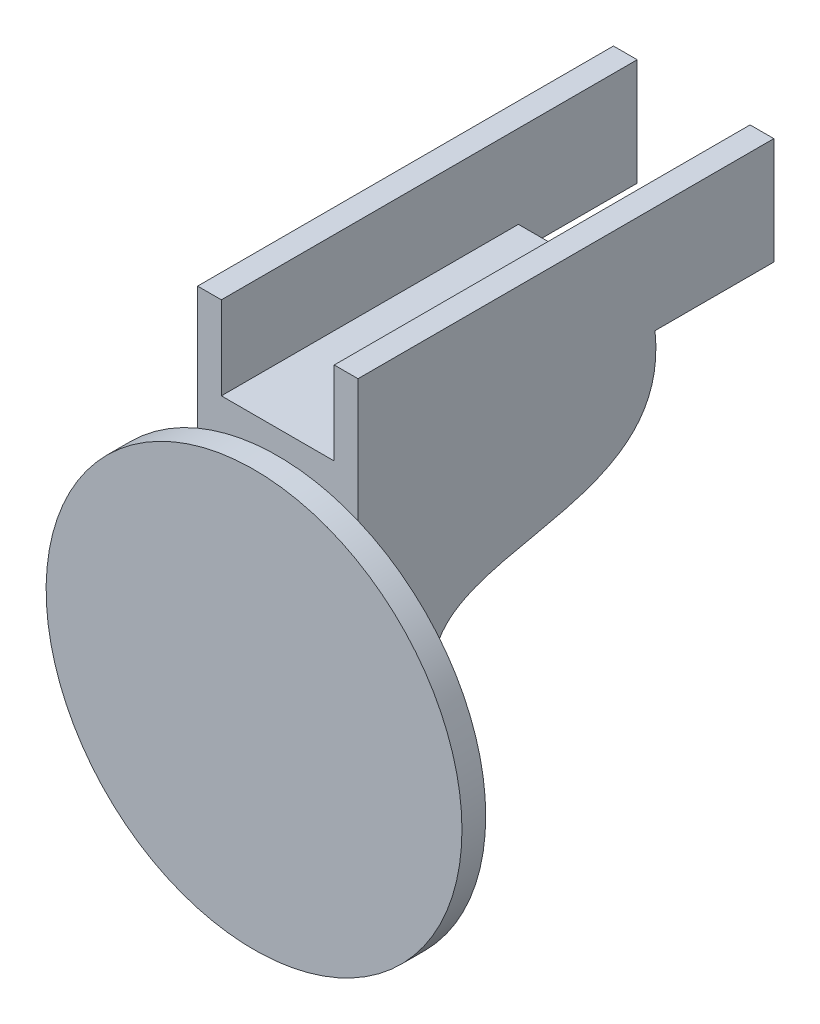
ISO-10303-21;
HEADER;
FILE_DESCRIPTION(('STEP AP214'),'2;1');
FILE_NAME('part.step','',(''),(''),'','','');
FILE_SCHEMA(('AUTOMOTIVE_DESIGN { 1 0 10303 214 1 1 1 1 }'));
ENDSEC;
DATA;
#1=APPLICATION_CONTEXT('core data for automotive mechanical design processes');
#2=APPLICATION_PROTOCOL_DEFINITION('international standard','automotive_design',2000,#1);
#3=PRODUCT_CONTEXT('',#1,'mechanical');
#4=PRODUCT('Part','Part','',(#3));
#5=PRODUCT_RELATED_PRODUCT_CATEGORY('part','',(#4));
#6=PRODUCT_DEFINITION_FORMATION('','',#4);
#7=PRODUCT_DEFINITION_CONTEXT('part definition',#1,'design');
#8=PRODUCT_DEFINITION('design','',#6,#7);
#9=PRODUCT_DEFINITION_SHAPE('','',#8);
#10=(LENGTH_UNIT() NAMED_UNIT(*) SI_UNIT(.MILLI.,.METRE.));
#11=(NAMED_UNIT(*) PLANE_ANGLE_UNIT() SI_UNIT($,.RADIAN.));
#12=(NAMED_UNIT(*) SI_UNIT($,.STERADIAN.) SOLID_ANGLE_UNIT());
#13=UNCERTAINTY_MEASURE_WITH_UNIT(LENGTH_MEASURE(1.E-05),#10,'distance_accuracy_value','');
#14=(GEOMETRIC_REPRESENTATION_CONTEXT(3) GLOBAL_UNCERTAINTY_ASSIGNED_CONTEXT((#13)) GLOBAL_UNIT_ASSIGNED_CONTEXT((#10,
#11,#12)) REPRESENTATION_CONTEXT('',''));
#15=CARTESIAN_POINT('',(0.,0.,0.));
#16=DIRECTION('',(0.,0.,1.));
#17=DIRECTION('',(1.,0.,0.));
#18=AXIS2_PLACEMENT_3D('',#15,#16,#17);
#19=CARTESIAN_POINT('',(-193.63213122225,-20.9301361800688,35.));
#20=DIRECTION('',(0.,1.,0.));
#21=DIRECTION('',(0.,0.,1.));
#22=AXIS2_PLACEMENT_3D('',#19,#20,#21);
#23=PLANE('',#22);
#24=DIRECTION('',(0.,0.,-1.));
#25=VECTOR('',#24,1.);
#26=CARTESIAN_POINT('',(-193.63213122225,-20.9301361800688,35.));
#27=LINE('',#26,#25);
#28=CARTESIAN_POINT('',(-193.63213122225,-20.9301361800688,10.));
#29=VERTEX_POINT('',#28);
#30=CARTESIAN_POINT('',(-193.63213122225,-20.9301361800688,0.));
#31=VERTEX_POINT('',#30);
#32=EDGE_CURVE('E227',#29,#31,#27,.T.);
#33=ORIENTED_EDGE('',*,*,#32,.F.);
#34=DIRECTION('',(1.,0.,0.));
#35=VECTOR('',#34,1.);
#36=CARTESIAN_POINT('',(-207.13213122225,-20.9301361800688,10.));
#37=LINE('',#36,#35);
#38=CARTESIAN_POINT('',(-195.63213122225,-20.9301361800688,10.));
#39=VERTEX_POINT('',#38);
#40=EDGE_CURVE('E163',#39,#29,#37,.T.);
#41=ORIENTED_EDGE('',*,*,#40,.F.);
#42=DIRECTION('',(0.,0.,-1.));
#43=VECTOR('',#42,1.);
#44=CARTESIAN_POINT('',(-195.63213122225,-20.9301361800688,35.));
#45=LINE('',#44,#43);
#46=CARTESIAN_POINT('',(-195.63213122225,-20.9301361800688,0.));
#47=VERTEX_POINT('',#46);
#48=EDGE_CURVE('E248',#39,#47,#45,.T.);
#49=ORIENTED_EDGE('',*,*,#48,.T.);
#50=DIRECTION('',(1.,0.,0.));
#51=VECTOR('',#50,1.);
#52=CARTESIAN_POINT('',(-193.63213122225,-20.9301361800688,0.));
#53=LINE('',#52,#51);
#54=EDGE_CURVE('E232',#47,#31,#53,.T.);
#55=ORIENTED_EDGE('',*,*,#54,.T.);
#56=EDGE_LOOP('',(#33,#41,#49,#55));
#57=FACE_BOUND('',#56,.T.);
#58=ADVANCED_FACE('F33',(#57),#23,.F.);
#59=CARTESIAN_POINT('',(0.,0.,0.));
#60=DIRECTION('',(0.,0.,-1.));
#61=DIRECTION('',(-1.,0.,0.));
#62=AXIS2_PLACEMENT_3D('',#59,#60,#61);
#63=PLANE('',#62);
#64=DIRECTION('',(0.,1.,0.));
#65=VECTOR('',#64,1.);
#66=CARTESIAN_POINT('',(-205.13213122225,-11.9301361800688,0.));
#67=LINE('',#66,#65);
#68=CARTESIAN_POINT('',(-205.13213122225,-20.9301361800688,0.));
#69=VERTEX_POINT('',#68);
#70=CARTESIAN_POINT('',(-205.13213122225,-11.9301361800688,0.));
#71=VERTEX_POINT('',#70);
#72=EDGE_CURVE('E260',#69,#71,#67,.T.);
#73=ORIENTED_EDGE('',*,*,#72,.F.);
#74=CARTESIAN_POINT('',(-207.13213122225,-20.9301361800688,0.));
#75=VERTEX_POINT('',#74);
#76=EDGE_CURVE('E278',#75,#69,#53,.T.);
#77=ORIENTED_EDGE('',*,*,#76,.F.);
#78=DIRECTION('',(0.,-1.,0.));
#79=VECTOR('',#78,1.);
#80=CARTESIAN_POINT('',(-207.13213122225,-20.9301361800688,0.));
#81=LINE('',#80,#79);
#82=CARTESIAN_POINT('',(-207.13213122225,-11.9301361800688,0.));
#83=VERTEX_POINT('',#82);
#84=EDGE_CURVE('E275',#83,#75,#81,.T.);
#85=ORIENTED_EDGE('',*,*,#84,.F.);
#86=DIRECTION('',(-1.,0.,0.));
#87=VECTOR('',#86,1.);
#88=CARTESIAN_POINT('',(-207.13213122225,-11.9301361800688,0.));
#89=LINE('',#88,#87);
#90=EDGE_CURVE('E255',#71,#83,#89,.T.);
#91=ORIENTED_EDGE('',*,*,#90,.F.);
#92=EDGE_LOOP('',(#73,#77,#85,#91));
#93=FACE_BOUND('',#92,.T.);
#94=ADVANCED_FACE('F189',(#93),#63,.T.);
#95=CARTESIAN_POINT('',(-207.13213122225,-11.9301361800688,35.));
#96=DIRECTION('',(0.,-1.,0.));
#97=DIRECTION('',(0.,0.,-1.));
#98=AXIS2_PLACEMENT_3D('',#95,#96,#97);
#99=PLANE('',#98);
#100=ORIENTED_EDGE('',*,*,#90,.T.);
#101=DIRECTION('',(0.,0.,-1.));
#102=VECTOR('',#101,1.);
#103=CARTESIAN_POINT('',(-207.13213122225,-11.9301361800688,35.));
#104=LINE('',#103,#102);
#105=CARTESIAN_POINT('',(-207.13213122225,-11.9301361800688,35.));
#106=VERTEX_POINT('',#105);
#107=EDGE_CURVE('E47',#106,#83,#104,.T.);
#108=ORIENTED_EDGE('',*,*,#107,.F.);
#109=DIRECTION('',(-1.,0.,0.));
#110=VECTOR('',#109,1.);
#111=CARTESIAN_POINT('',(-207.13213122225,-11.9301361800688,35.));
#112=LINE('',#111,#110);
#113=CARTESIAN_POINT('',(-205.13213122225,-11.9301361800688,35.));
#114=VERTEX_POINT('',#113);
#115=EDGE_CURVE('E256',#114,#106,#112,.T.);
#116=ORIENTED_EDGE('',*,*,#115,.F.);
#117=DIRECTION('',(0.,0.,-1.));
#118=VECTOR('',#117,1.);
#119=CARTESIAN_POINT('',(-205.13213122225,-11.9301361800688,35.));
#120=LINE('',#119,#118);
#121=EDGE_CURVE('E272',#114,#71,#120,.T.);
#122=ORIENTED_EDGE('',*,*,#121,.T.);
#123=EDGE_LOOP('',(#100,#108,#116,#122));
#124=FACE_BOUND('',#123,.T.);
#125=ADVANCED_FACE('F35',(#124),#99,.F.);
#126=CARTESIAN_POINT('',(-207.13213122225,-20.9301361800688,35.));
#127=DIRECTION('',(1.,0.,0.));
#128=DIRECTION('',(0.,0.,-1.));
#129=AXIS2_PLACEMENT_3D('',#126,#127,#128);
#130=PLANE('',#129);
#131=CARTESIAN_POINT('',(-207.13213122225,-55.9301361800688,35.));
#132=CARTESIAN_POINT('',(-207.13213122225,-54.2873215879042,23.0609088412956));
#133=CARTESIAN_POINT('',(-207.13213122225,-25.1690256027346,40.4363403410607));
#134=CARTESIAN_POINT('',(-207.13213122225,-32.6227513641706,8.75468883506231));
#135=CARTESIAN_POINT('',(-207.13213122225,-20.9301361800688,10.));
#136=B_SPLINE_CURVE_WITH_KNOTS('',3,(#131,#132,#133,#134,#135),.UNSPECIFIED.,.F.,.F.,(4,1,4),
(0.,0.529196365880174,1.),.UNSPECIFIED.);
#137=CARTESIAN_POINT('',(-207.13213122225,-54.5759560725363,31.2410451819246));
#138=VERTEX_POINT('',#137);
#139=CARTESIAN_POINT('',(-207.13213122225,-20.9301361800688,10.));
#140=VERTEX_POINT('',#139);
#141=EDGE_CURVE('E141',#138,#140,#136,.T.);
#142=ORIENTED_EDGE('',*,*,#141,.F.);
#143=DIRECTION('',(0.,0.,1.));
#144=VECTOR('',#143,1.);
#145=CARTESIAN_POINT('',(-207.13213122225,-54.5759560725363,30.));
#146=LINE('',#145,#144);
#147=CARTESIAN_POINT('',(-207.13213122225,-54.5759560725363,35.));
#148=VERTEX_POINT('',#147);
#149=EDGE_CURVE('E135',#138,#148,#146,.T.);
#150=ORIENTED_EDGE('',*,*,#149,.T.);
#151=DIRECTION('',(0.,-1.,0.));
#152=VECTOR('',#151,1.);
#153=CARTESIAN_POINT('',(-207.13213122225,-20.9301361800688,35.));
#154=LINE('',#153,#152);
#155=CARTESIAN_POINT('',(-207.13213122225,-22.2843162876013,35.));
#156=VERTEX_POINT('',#155);
#157=EDGE_CURVE('E138',#156,#148,#154,.T.);
#158=ORIENTED_EDGE('',*,*,#157,.F.);
#159=DIRECTION('',(0.,-1.,0.));
#160=VECTOR('',#159,1.);
#161=CARTESIAN_POINT('',(-207.13213122225,-11.9301361800688,35.));
#162=LINE('',#161,#160);
#163=EDGE_CURVE('E259',#106,#156,#162,.T.);
#164=ORIENTED_EDGE('',*,*,#163,.F.);
#165=ORIENTED_EDGE('',*,*,#107,.T.);
#166=ORIENTED_EDGE('',*,*,#84,.T.);
#167=DIRECTION('',(0.,0.,-1.));
#168=VECTOR('',#167,1.);
#169=CARTESIAN_POINT('',(-207.13213122225,-20.9301361800688,35.));
#170=LINE('',#169,#168);
#171=EDGE_CURVE('E234',#140,#75,#170,.T.);
#172=ORIENTED_EDGE('',*,*,#171,.F.);
#173=EDGE_LOOP('',(#142,#150,#158,#164,#165,#166,#172));
#174=FACE_BOUND('',#173,.T.);
#175=ADVANCED_FACE('F137',(#174),#130,.F.);
#176=DIRECTION('',(0.,0.,1.));
#177=VECTOR('',#176,1.);
#178=CARTESIAN_POINT('',(-205.13213122225,-20.9301361800688,35.));
#179=LINE('',#178,#177);
#180=CARTESIAN_POINT('',(-205.13213122225,-20.9301361800688,10.));
#181=VERTEX_POINT('',#180);
#182=EDGE_CURVE('E251',#69,#181,#179,.T.);
#183=ORIENTED_EDGE('',*,*,#182,.T.);
#184=EDGE_CURVE('E240',#140,#181,#37,.T.);
#185=ORIENTED_EDGE('',*,*,#184,.F.);
#186=ORIENTED_EDGE('',*,*,#171,.T.);
#187=ORIENTED_EDGE('',*,*,#76,.T.);
#188=EDGE_LOOP('',(#183,#185,#186,#187));
#189=FACE_BOUND('',#188,.T.);
#190=ADVANCED_FACE('F208',(#189),#23,.F.);
#191=CARTESIAN_POINT('',(-193.63213122225,-11.9301361800688,35.));
#192=DIRECTION('',(-1.,0.,0.));
#193=DIRECTION('',(0.,0.,1.));
#194=AXIS2_PLACEMENT_3D('',#191,#192,#193);
#195=PLANE('',#194);
#196=DIRECTION('',(0.,1.,0.));
#197=VECTOR('',#196,1.);
#198=CARTESIAN_POINT('',(-193.63213122225,-11.9301361800688,35.));
#199=LINE('',#198,#197);
#200=CARTESIAN_POINT('',(-193.63213122225,-54.5759560725363,35.));
#201=VERTEX_POINT('',#200);
#202=CARTESIAN_POINT('',(-193.63213122225,-22.2843162876013,35.));
#203=VERTEX_POINT('',#202);
#204=EDGE_CURVE('E148',#201,#203,#199,.T.);
#205=ORIENTED_EDGE('',*,*,#204,.F.);
#206=DIRECTION('',(0.,0.,1.));
#207=VECTOR('',#206,1.);
#208=CARTESIAN_POINT('',(-193.63213122225,-54.5759560725363,30.));
#209=LINE('',#208,#207);
#210=CARTESIAN_POINT('',(-193.63213122225,-54.5759560725363,31.2410451819244));
#211=VERTEX_POINT('',#210);
#212=EDGE_CURVE('E61',#211,#201,#209,.T.);
#213=ORIENTED_EDGE('',*,*,#212,.F.);
#214=CARTESIAN_POINT('',(-193.63213122225,-55.9301361800688,35.));
#215=CARTESIAN_POINT('',(-193.63213122225,-54.2873215879042,23.0609088412956));
#216=CARTESIAN_POINT('',(-193.63213122225,-25.1690256027346,40.4363403410607));
#217=CARTESIAN_POINT('',(-193.63213122225,-32.6227513641706,8.75468883506231));
#218=CARTESIAN_POINT('',(-193.63213122225,-20.9301361800688,10.));
#219=B_SPLINE_CURVE_WITH_KNOTS('',3,(#214,#215,#216,#217,#218),.UNSPECIFIED.,.F.,.F.,(4,1,4),
(0.,0.529196365880174,1.),.UNSPECIFIED.);
#220=EDGE_CURVE('E147',#211,#29,#219,.T.);
#221=ORIENTED_EDGE('',*,*,#220,.T.);
#222=ORIENTED_EDGE('',*,*,#32,.T.);
#223=DIRECTION('',(0.,1.,0.));
#224=VECTOR('',#223,1.);
#225=CARTESIAN_POINT('',(-193.63213122225,-11.9301361800688,0.));
#226=LINE('',#225,#224);
#227=CARTESIAN_POINT('',(-193.63213122225,-11.9301361800688,0.));
#228=VERTEX_POINT('',#227);
#229=EDGE_CURVE('E281',#31,#228,#226,.T.);
#230=ORIENTED_EDGE('',*,*,#229,.T.);
#231=DIRECTION('',(0.,0.,-1.));
#232=VECTOR('',#231,1.);
#233=CARTESIAN_POINT('',(-193.63213122225,-11.9301361800688,35.));
#234=LINE('',#233,#232);
#235=CARTESIAN_POINT('',(-193.63213122225,-11.9301361800688,35.));
#236=VERTEX_POINT('',#235);
#237=EDGE_CURVE('E235',#236,#228,#234,.T.);
#238=ORIENTED_EDGE('',*,*,#237,.F.);
#239=DIRECTION('',(0.,1.,0.));
#240=VECTOR('',#239,1.);
#241=CARTESIAN_POINT('',(-193.63213122225,-11.9301361800688,35.));
#242=LINE('',#241,#240);
#243=EDGE_CURVE('E262',#203,#236,#242,.T.);
#244=ORIENTED_EDGE('',*,*,#243,.F.);
#245=EDGE_LOOP('',(#205,#213,#221,#222,#230,#238,#244));
#246=FACE_BOUND('',#245,.T.);
#247=ADVANCED_FACE('F204',(#246),#195,.F.);
#248=CARTESIAN_POINT('',(-195.63213122225,-11.9301361800688,35.));
#249=DIRECTION('',(0.,-1.,0.));
#250=DIRECTION('',(0.,0.,-1.));
#251=AXIS2_PLACEMENT_3D('',#248,#249,#250);
#252=PLANE('',#251);
#253=DIRECTION('',(-1.,0.,0.));
#254=VECTOR('',#253,1.);
#255=CARTESIAN_POINT('',(-195.63213122225,-11.9301361800688,0.));
#256=LINE('',#255,#254);
#257=CARTESIAN_POINT('',(-195.63213122225,-11.9301361800688,0.));
#258=VERTEX_POINT('',#257);
#259=EDGE_CURVE('E283',#228,#258,#256,.T.);
#260=ORIENTED_EDGE('',*,*,#259,.T.);
#261=DIRECTION('',(0.,0.,-1.));
#262=VECTOR('',#261,1.);
#263=CARTESIAN_POINT('',(-195.63213122225,-11.9301361800688,35.));
#264=LINE('',#263,#262);
#265=CARTESIAN_POINT('',(-195.63213122225,-11.9301361800688,35.));
#266=VERTEX_POINT('',#265);
#267=EDGE_CURVE('E296',#266,#258,#264,.T.);
#268=ORIENTED_EDGE('',*,*,#267,.F.);
#269=DIRECTION('',(-1.,0.,0.));
#270=VECTOR('',#269,1.);
#271=CARTESIAN_POINT('',(-195.63213122225,-11.9301361800688,35.));
#272=LINE('',#271,#270);
#273=EDGE_CURVE('E264',#236,#266,#272,.T.);
#274=ORIENTED_EDGE('',*,*,#273,.F.);
#275=ORIENTED_EDGE('',*,*,#237,.T.);
#276=EDGE_LOOP('',(#260,#268,#274,#275));
#277=FACE_BOUND('',#276,.T.);
#278=ADVANCED_FACE('F200',(#277),#252,.F.);
#279=CARTESIAN_POINT('',(-195.63213122225,-18.9301361800688,35.));
#280=DIRECTION('',(1.,0.,0.));
#281=DIRECTION('',(0.,0.,-1.));
#282=AXIS2_PLACEMENT_3D('',#279,#280,#281);
#283=PLANE('',#282);
#284=DIRECTION('',(0.,-1.,0.));
#285=VECTOR('',#284,1.);
#286=CARTESIAN_POINT('',(-195.63213122225,-18.9301361800688,0.));
#287=LINE('',#286,#285);
#288=EDGE_CURVE('E285',#258,#47,#287,.T.);
#289=ORIENTED_EDGE('',*,*,#288,.T.);
#290=ORIENTED_EDGE('',*,*,#48,.F.);
#291=DIRECTION('',(0.,1.,0.));
#292=VECTOR('',#291,1.);
#293=CARTESIAN_POINT('',(-195.63213122225,-88.9301361800688,10.));
#294=LINE('',#293,#292);
#295=CARTESIAN_POINT('',(-195.63213122225,-18.9301361800688,10.));
#296=VERTEX_POINT('',#295);
#297=EDGE_CURVE('E246',#39,#296,#294,.T.);
#298=ORIENTED_EDGE('',*,*,#297,.T.);
#299=DIRECTION('',(0.,0.,-1.));
#300=VECTOR('',#299,1.);
#301=CARTESIAN_POINT('',(-195.63213122225,-18.9301361800688,35.));
#302=LINE('',#301,#300);
#303=CARTESIAN_POINT('',(-195.63213122225,-18.9301361800688,35.));
#304=VERTEX_POINT('',#303);
#305=EDGE_CURVE('E293',#304,#296,#302,.T.);
#306=ORIENTED_EDGE('',*,*,#305,.F.);
#307=DIRECTION('',(0.,-1.,0.));
#308=VECTOR('',#307,1.);
#309=CARTESIAN_POINT('',(-195.63213122225,-18.9301361800688,35.));
#310=LINE('',#309,#308);
#311=EDGE_CURVE('E266',#266,#304,#310,.T.);
#312=ORIENTED_EDGE('',*,*,#311,.F.);
#313=ORIENTED_EDGE('',*,*,#267,.T.);
#314=EDGE_LOOP('',(#289,#290,#298,#306,#312,#313));
#315=FACE_BOUND('',#314,.T.);
#316=ADVANCED_FACE('F196',(#315),#283,.F.);
#317=CARTESIAN_POINT('',(-205.13213122225,-18.9301361800688,35.));
#318=DIRECTION('',(0.,-1.,0.));
#319=DIRECTION('',(0.,0.,-1.));
#320=AXIS2_PLACEMENT_3D('',#317,#318,#319);
#321=PLANE('',#320);
#322=ORIENTED_EDGE('',*,*,#305,.T.);
#323=DIRECTION('',(1.,0.,0.));
#324=VECTOR('',#323,1.);
#325=CARTESIAN_POINT('',(-205.13213122225,-18.9301361800688,10.));
#326=LINE('',#325,#324);
#327=CARTESIAN_POINT('',(-205.13213122225,-18.9301361800688,10.));
#328=VERTEX_POINT('',#327);
#329=EDGE_CURVE('E241',#328,#296,#326,.T.);
#330=ORIENTED_EDGE('',*,*,#329,.F.);
#331=DIRECTION('',(0.,0.,-1.));
#332=VECTOR('',#331,1.);
#333=CARTESIAN_POINT('',(-205.13213122225,-18.9301361800688,35.));
#334=LINE('',#333,#332);
#335=CARTESIAN_POINT('',(-205.13213122225,-18.9301361800688,35.));
#336=VERTEX_POINT('',#335);
#337=EDGE_CURVE('E290',#336,#328,#334,.T.);
#338=ORIENTED_EDGE('',*,*,#337,.F.);
#339=DIRECTION('',(-1.,0.,0.));
#340=VECTOR('',#339,1.);
#341=CARTESIAN_POINT('',(-205.13213122225,-18.9301361800688,35.));
#342=LINE('',#341,#340);
#343=EDGE_CURVE('E268',#304,#336,#342,.T.);
#344=ORIENTED_EDGE('',*,*,#343,.F.);
#345=EDGE_LOOP('',(#322,#330,#338,#344));
#346=FACE_BOUND('',#345,.T.);
#347=ADVANCED_FACE('F192',(#346),#321,.F.);
#348=CARTESIAN_POINT('',(-205.13213122225,-11.9301361800688,35.));
#349=DIRECTION('',(-1.,0.,0.));
#350=DIRECTION('',(0.,0.,1.));
#351=AXIS2_PLACEMENT_3D('',#348,#349,#350);
#352=PLANE('',#351);
#353=ORIENTED_EDGE('',*,*,#72,.T.);
#354=ORIENTED_EDGE('',*,*,#121,.F.);
#355=DIRECTION('',(0.,1.,0.));
#356=VECTOR('',#355,1.);
#357=CARTESIAN_POINT('',(-205.13213122225,-11.9301361800688,35.));
#358=LINE('',#357,#356);
#359=EDGE_CURVE('E270',#336,#114,#358,.T.);
#360=ORIENTED_EDGE('',*,*,#359,.F.);
#361=ORIENTED_EDGE('',*,*,#337,.T.);
#362=DIRECTION('',(0.,1.,0.));
#363=VECTOR('',#362,1.);
#364=CARTESIAN_POINT('',(-205.13213122225,-88.9301361800688,10.));
#365=LINE('',#364,#363);
#366=EDGE_CURVE('E245',#181,#328,#365,.T.);
#367=ORIENTED_EDGE('',*,*,#366,.F.);
#368=ORIENTED_EDGE('',*,*,#182,.F.);
#369=EDGE_LOOP('',(#353,#354,#360,#361,#367,#368));
#370=FACE_BOUND('',#369,.T.);
#371=ADVANCED_FACE('F185',(#370),#352,.F.);
#372=CARTESIAN_POINT('',(0.,0.,35.));
#373=DIRECTION('',(0.,0.,-1.));
#374=DIRECTION('',(-1.,0.,0.));
#375=AXIS2_PLACEMENT_3D('',#372,#373,#374);
#376=PLANE('',#375);
#377=CARTESIAN_POINT('',(-200.38213122225,-38.4301361800688,35.));
#378=DIRECTION('',(0.,0.,1.));
#379=DIRECTION('',(1.,0.,0.));
#380=AXIS2_PLACEMENT_3D('',#377,#378,#379);
#381=CIRCLE('',#380,17.5);
#382=EDGE_CURVE('E54',#203,#156,#381,.T.);
#383=ORIENTED_EDGE('',*,*,#382,.F.);
#384=ORIENTED_EDGE('',*,*,#243,.T.);
#385=ORIENTED_EDGE('',*,*,#273,.T.);
#386=ORIENTED_EDGE('',*,*,#311,.T.);
#387=ORIENTED_EDGE('',*,*,#343,.T.);
#388=ORIENTED_EDGE('',*,*,#359,.T.);
#389=ORIENTED_EDGE('',*,*,#115,.T.);
#390=ORIENTED_EDGE('',*,*,#163,.T.);
#391=EDGE_LOOP('',(#383,#384,#385,#386,#387,#388,#389,#390));
#392=FACE_BOUND('',#391,.T.);
#393=ADVANCED_FACE('F182',(#392),#376,.F.);
#394=ORIENTED_EDGE('',*,*,#54,.F.);
#395=ORIENTED_EDGE('',*,*,#288,.F.);
#396=ORIENTED_EDGE('',*,*,#259,.F.);
#397=ORIENTED_EDGE('',*,*,#229,.F.);
#398=EDGE_LOOP('',(#394,#395,#396,#397));
#399=FACE_BOUND('',#398,.T.);
#400=ADVANCED_FACE('F180',(#399),#63,.T.);
#401=CARTESIAN_POINT('',(-205.13213122225,-88.9301361800688,10.));
#402=DIRECTION('',(0.,0.,1.));
#403=DIRECTION('',(1.,0.,0.));
#404=AXIS2_PLACEMENT_3D('',#401,#402,#403);
#405=PLANE('',#404);
#406=ORIENTED_EDGE('',*,*,#366,.T.);
#407=ORIENTED_EDGE('',*,*,#329,.T.);
#408=ORIENTED_EDGE('',*,*,#297,.F.);
#409=DIRECTION('',(1.,0.,0.));
#410=VECTOR('',#409,1.);
#411=CARTESIAN_POINT('',(-193.63213122225,-20.9301361800688,10.));
#412=LINE('',#411,#410);
#413=EDGE_CURVE('E239',#181,#39,#412,.T.);
#414=ORIENTED_EDGE('',*,*,#413,.F.);
#415=EDGE_LOOP('',(#406,#407,#408,#414));
#416=FACE_BOUND('',#415,.T.);
#417=ADVANCED_FACE('F175',(#416),#405,.F.);
#418=DIRECTION('',(1.,0.,0.));
#419=VECTOR('',#418,1.);
#420=SURFACE_OF_LINEAR_EXTRUSION('',#136,#419);
#421=CARTESIAN_POINT('',(-207.13213122225,-54.5759560725365,31.2410451819246));
#422=CARTESIAN_POINT('',(-206.998010990833,-54.6320259942286,31.3195097813312));
#423=CARTESIAN_POINT('',(-206.863864560859,-54.6861457010801,31.3993112377888));
#424=CARTESIAN_POINT('',(-206.595655939778,-54.7905400560798,31.5613282722925));
#425=CARTESIAN_POINT('',(-206.461593747009,-54.8408170204276,31.6435423541094));
#426=CARTESIAN_POINT('',(-206.193564931703,-54.9376355255816,31.8101973982224));
#427=CARTESIAN_POINT('',(-206.059598292875,-54.9841781160354,31.894637725843));
#428=CARTESIAN_POINT('',(-205.791745025642,-55.0736338772276,32.0655247802447));
#429=CARTESIAN_POINT('',(-205.657858393561,-55.1165472298891,32.1519714061788));
#430=CARTESIAN_POINT('',(-205.390495971913,-55.1987315343326,32.3263728252024));
#431=CARTESIAN_POINT('',(-205.257020041709,-55.2380119260878,32.414322963273));
#432=CARTESIAN_POINT('',(-204.990040517719,-55.3131574228797,32.5916540769216));
#433=CARTESIAN_POINT('',(-204.856536922516,-55.3490222132576,32.6810351834417));
#434=CARTESIAN_POINT('',(-204.58938379927,-55.4174267162973,32.8608505146779));
#435=CARTESIAN_POINT('',(-204.455734267439,-55.4499663405038,32.9512847673383));
#436=CARTESIAN_POINT('',(-204.188103535782,-55.5118058717735,33.1327325259375));
#437=CARTESIAN_POINT('',(-204.054122376628,-55.5411061577809,33.2237459628021));
#438=CARTESIAN_POINT('',(-203.819746891051,-55.5894844959553,33.3825508056562));
#439=CARTESIAN_POINT('',(-203.719499368761,-55.6092640588294,33.4503461336836));
#440=CARTESIAN_POINT('',(-203.518456368409,-55.6471024858568,33.5855983160217));
#441=CARTESIAN_POINT('',(-203.417660907485,-55.6651614034992,33.6530551807924));
#442=CARTESIAN_POINT('',(-203.215256588064,-55.6995873023637,33.7872278900673));
#443=CARTESIAN_POINT('',(-203.11364755548,-55.7159539104483,33.8539435682652));
#444=CARTESIAN_POINT('',(-202.909137945129,-55.7470341713043,33.9861780995918));
#445=CARTESIAN_POINT('',(-202.806235386591,-55.7617448230389,34.0516946051885));
#446=CARTESIAN_POINT('',(-202.598914951979,-55.7894796652091,34.1806283894805));
#447=CARTESIAN_POINT('',(-202.494497339697,-55.8025041454019,34.2440460274543));
#448=CARTESIAN_POINT('',(-202.283630886739,-55.8268476026083,34.3676964125766));
#449=CARTESIAN_POINT('',(-202.177182717578,-55.8381671328057,34.4279301886182));
#450=CARTESIAN_POINT('',(-201.980873821435,-55.8571815879177,34.533302455492));
#451=CARTESIAN_POINT('',(-201.891461665618,-55.8651624876435,34.5792109397601));
#452=CARTESIAN_POINT('',(-201.710429047966,-55.8798897316439,34.6666326887114));
#453=CARTESIAN_POINT('',(-201.618807950757,-55.8866357157982,34.7081446698241));
#454=CARTESIAN_POINT('',(-201.340654103109,-55.9048477607011,34.8234284113241));
#455=CARTESIAN_POINT('',(-201.149915692936,-55.9143790487092,34.8884751088331));
#456=CARTESIAN_POINT('',(-200.860538400591,-55.9238481450136,34.95474594191));
#457=CARTESIAN_POINT('',(-200.765569623779,-55.9261973437831,34.9715696787655));
#458=CARTESIAN_POINT('',(-200.574429417013,-55.9293393748432,34.9941806796144));
#459=CARTESIAN_POINT('',(-200.478260918057,-55.9301354522109,34.999990954306));
#460=CARTESIAN_POINT('',(-200.324273632257,-55.9301366181448,35.0000054443328));
#461=CARTESIAN_POINT('',(-200.266430098611,-55.9298489427523,34.9979094072573));
#462=CARTESIAN_POINT('',(-200.151000371955,-55.9287049120171,34.9896234558055));
#463=CARTESIAN_POINT('',(-200.093414375198,-55.9278481794063,34.9834308255206));
#464=CARTESIAN_POINT('',(-199.978807561443,-55.9255817966928,34.9671886273196));
#465=CARTESIAN_POINT('',(-199.921786749633,-55.9241721415195,34.9571390240339));
#466=CARTESIAN_POINT('',(-199.808064179623,-55.920811065037,34.9334514723254));
#467=CARTESIAN_POINT('',(-199.751368176859,-55.9188555914699,34.9197867256068));
#468=CARTESIAN_POINT('',(-199.638858973041,-55.9144353259626,34.8893305513428));
#469=CARTESIAN_POINT('',(-199.583045642335,-55.9119706095854,34.8725395877119));
#470=CARTESIAN_POINT('',(-199.47234864371,-55.906559281753,34.8362606085472));
#471=CARTESIAN_POINT('',(-199.417464772619,-55.9036127771526,34.8167731912018));
#472=CARTESIAN_POINT('',(-199.217175845889,-55.8919300403729,34.7408773546537));
#473=CARTESIAN_POINT('',(-199.074523078493,-55.8817799377186,34.6774197157571));
#474=CARTESIAN_POINT('',(-198.79425552335,-55.8585178454322,34.5403013301536));
#475=CARTESIAN_POINT('',(-198.656653714948,-55.8453987718878,34.4666163464966));
#476=CARTESIAN_POINT('',(-198.384817496382,-55.8163222004243,34.3128566414409));
#477=CARTESIAN_POINT('',(-198.250595481089,-55.8003556178711,34.2327619352876));
#478=CARTESIAN_POINT('',(-197.984699016203,-55.7656576122697,34.0688596026328));
#479=CARTESIAN_POINT('',(-197.853026461561,-55.7469242156948,33.9850493560033));
#480=CARTESIAN_POINT('',(-197.5902053519,-55.7065069254217,33.8145928823339));
#481=CARTESIAN_POINT('',(-197.459073377735,-55.6847969344348,33.727927393873));
#482=CARTESIAN_POINT('',(-197.198263361824,-55.6385782829728,33.5538470131776));
#483=CARTESIAN_POINT('',(-197.06858262418,-55.6140763308162,33.46643436526));
#484=CARTESIAN_POINT('',(-196.810076370482,-55.5622049051397,33.2915475438753));
#485=CARTESIAN_POINT('',(-196.681250000096,-55.5348389881229,33.2040735776123));
#486=CARTESIAN_POINT('',(-196.42400251659,-55.4771473396377,33.0295417955648));
#487=CARTESIAN_POINT('',(-196.295581353048,-55.4468219927377,32.9424839272479));
#488=CARTESIAN_POINT('',(-196.06099507991,-55.3886079720907,32.7841141351909));
#489=CARTESIAN_POINT('',(-195.954800964939,-55.3611972715032,32.7126693150642));
#490=CARTESIAN_POINT('',(-195.742402412596,-55.3042291317669,32.5705226867736));
#491=CARTESIAN_POINT('',(-195.636198001028,-55.2746705330566,32.4998213038921));
#492=CARTESIAN_POINT('',(-195.423752626681,-55.2133631585065,32.3593545040547));
#493=CARTESIAN_POINT('',(-195.317511662592,-55.1816137206165,32.2895893777013));
#494=CARTESIAN_POINT('',(-195.104984103244,-55.115881340639,32.1511612836186));
#495=CARTESIAN_POINT('',(-194.998697504264,-55.0818981546497,32.0824984372686));
#496=CARTESIAN_POINT('',(-194.787401411449,-55.012090932342,31.9472643149806));
#497=CARTESIAN_POINT('',(-194.682392476538,-54.9762950510567,31.8806776463238));
#498=CARTESIAN_POINT('',(-194.472348611286,-54.9024420503312,31.7488450528923));
#499=CARTESIAN_POINT('',(-194.367313686254,-54.8643852320592,31.6835989510986));
#500=CARTESIAN_POINT('',(-194.157238627877,-54.7859694080109,31.5545579180888));
#501=CARTESIAN_POINT('',(-194.052198498671,-54.7456108068731,31.490762734552));
#502=CARTESIAN_POINT('',(-193.842143164877,-54.6625514863058,31.3647210272629));
#503=CARTESIAN_POINT('',(-193.737127959129,-54.6198511750725,31.3024742363344));
#504=CARTESIAN_POINT('',(-193.63213122225,-54.5759560725364,31.2410451819244));
#505=B_SPLINE_CURVE_WITH_KNOTS('',3,(#421,#422,#423,#424,#425,#426,#427,#428,#429,#430,#431,
#432,#433,#434,#435,#436,#437,#438,#439,#440,#441,#442,#443,#444,#445,#446,#447,#448,#449,#450,
#451,#452,#453,#454,#455,#456,#457,#458,#459,#460,#461,#462,#463,#464,#465,#466,#467,#468,#469,
#470,#471,#472,#473,#474,#475,#476,#477,#478,#479,#480,#481,#482,#483,#484,#485,#486,#487,#488,
#489,#490,#491,#492,#493,#494,#495,#496,#497,#498,#499,#500,#501,#502,#503,#504),.UNSPECIFIED.,
.F.,.F.,(4,2,2,2,2,2,2,2,2,2,2,2,2,2,2,2,2,2,2,2,2,2,2,2,2,2,2,2,2,2,2,2,2,2,2,2,2,2,2,2,2,4),
(0.,0.495554158877581,0.990807229314558,1.48592060413247,1.98100914564622,2.47477279976589,
2.96858189744019,3.4624041278614,3.95616852869928,4.32403264919537,4.69188533029045,
5.05981894704928,5.42840897355948,5.79693557602249,6.16534234848582,6.46768437244673,
6.77011442402411,7.37180694170174,7.66069753916812,7.9489838822091,8.12249481342074,
8.29612089219674,8.46974856321435,8.64470122966687,8.81962795470887,8.99451593557741,
9.46307342047779,9.93276088774946,10.4039745535756,10.8755259669448,11.3515132121208,
11.8263799917657,12.3006639207419,12.7748862999007,13.167546233158,13.5604197451214,
13.9534125039803,14.346448245054,14.734595230983,15.1226906292173,15.5107180118575,
15.8986779690245),.UNSPECIFIED.);
#506=EDGE_CURVE('E11',#138,#211,#505,.T.);
#507=ORIENTED_EDGE('',*,*,#506,.F.);
#508=ORIENTED_EDGE('',*,*,#141,.T.);
#509=ORIENTED_EDGE('',*,*,#184,.T.);
#510=ORIENTED_EDGE('',*,*,#413,.T.);
#511=ORIENTED_EDGE('',*,*,#40,.T.);
#512=ORIENTED_EDGE('',*,*,#220,.F.);
#513=EDGE_LOOP('',(#507,#508,#509,#510,#511,#512));
#514=FACE_BOUND('',#513,.T.);
#515=ADVANCED_FACE('F170',(#514),#420,.T.);
#516=CARTESIAN_POINT('',(-200.38213122225,-38.4301361800688,35.));
#517=DIRECTION('',(0.,0.,1.));
#518=DIRECTION('',(1.,0.,0.));
#519=AXIS2_PLACEMENT_3D('',#516,#517,#518);
#520=PLANE('',#519);
#521=EDGE_CURVE('E146',#156,#148,#381,.T.);
#522=ORIENTED_EDGE('',*,*,#521,.F.);
#523=ORIENTED_EDGE('',*,*,#157,.T.);
#524=EDGE_LOOP('',(#522,#523));
#525=FACE_BOUND('',#524,.T.);
#526=ADVANCED_FACE('F145',(#525),#520,.F.);
#527=EDGE_CURVE('E151',#201,#203,#381,.T.);
#528=ORIENTED_EDGE('',*,*,#527,.F.);
#529=ORIENTED_EDGE('',*,*,#204,.T.);
#530=EDGE_LOOP('',(#528,#529));
#531=FACE_BOUND('',#530,.T.);
#532=ADVANCED_FACE('F312',(#531),#520,.F.);
#533=CARTESIAN_POINT('',(-200.38213122225,-38.4301361800688,37.));
#534=DIRECTION('',(0.,0.,-1.));
#535=DIRECTION('',(-1.,0.,0.));
#536=AXIS2_PLACEMENT_3D('',#533,#534,#535);
#537=CYLINDRICAL_SURFACE('',#536,17.5);
#538=CARTESIAN_POINT('',(-200.38213122225,-38.4301361800688,37.));
#539=DIRECTION('',(0.,0.,1.));
#540=DIRECTION('',(1.,0.,0.));
#541=AXIS2_PLACEMENT_3D('',#538,#539,#540);
#542=CIRCLE('',#541,17.5);
#543=CARTESIAN_POINT('',(-182.88213122225,-38.4301361800688,37.));
#544=VERTEX_POINT('',#543);
#545=EDGE_CURVE('E153',#544,#544,#542,.T.);
#546=ORIENTED_EDGE('',*,*,#545,.F.);
#547=EDGE_LOOP('',(#546));
#548=FACE_BOUND('',#547,.T.);
#549=ORIENTED_EDGE('',*,*,#382,.T.);
#550=ORIENTED_EDGE('',*,*,#521,.T.);
#551=ORIENTED_EDGE('',*,*,#149,.F.);
#552=ORIENTED_EDGE('',*,*,#506,.T.);
#553=ORIENTED_EDGE('',*,*,#212,.T.);
#554=ORIENTED_EDGE('',*,*,#527,.T.);
#555=EDGE_LOOP('',(#549,#550,#551,#552,#553,#554));
#556=FACE_BOUND('',#555,.T.);
#557=ADVANCED_FACE('F150',(#548,#556),#537,.T.);
#558=CARTESIAN_POINT('',(-200.38213122225,-38.4301361800688,37.));
#559=DIRECTION('',(0.,0.,1.));
#560=DIRECTION('',(1.,0.,0.));
#561=AXIS2_PLACEMENT_3D('',#558,#559,#560);
#562=PLANE('',#561);
#563=ORIENTED_EDGE('',*,*,#545,.T.);
#564=EDGE_LOOP('',(#563));
#565=FACE_BOUND('',#564,.T.);
#566=ADVANCED_FACE('F318',(#565),#562,.T.);
#567=CLOSED_SHELL('',(#58,#94,#125,#175,#190,#247,#278,#316,#347,#371,#393,#400,#417,#515,#526,
#532,#557,#566));
#568=MANIFOLD_SOLID_BREP('B2',#567);
#569=ADVANCED_BREP_SHAPE_REPRESENTATION('',(#18,#568),#14);
#570=SHAPE_DEFINITION_REPRESENTATION(#9,#569);
ENDSEC;
END-ISO-10303-21;
